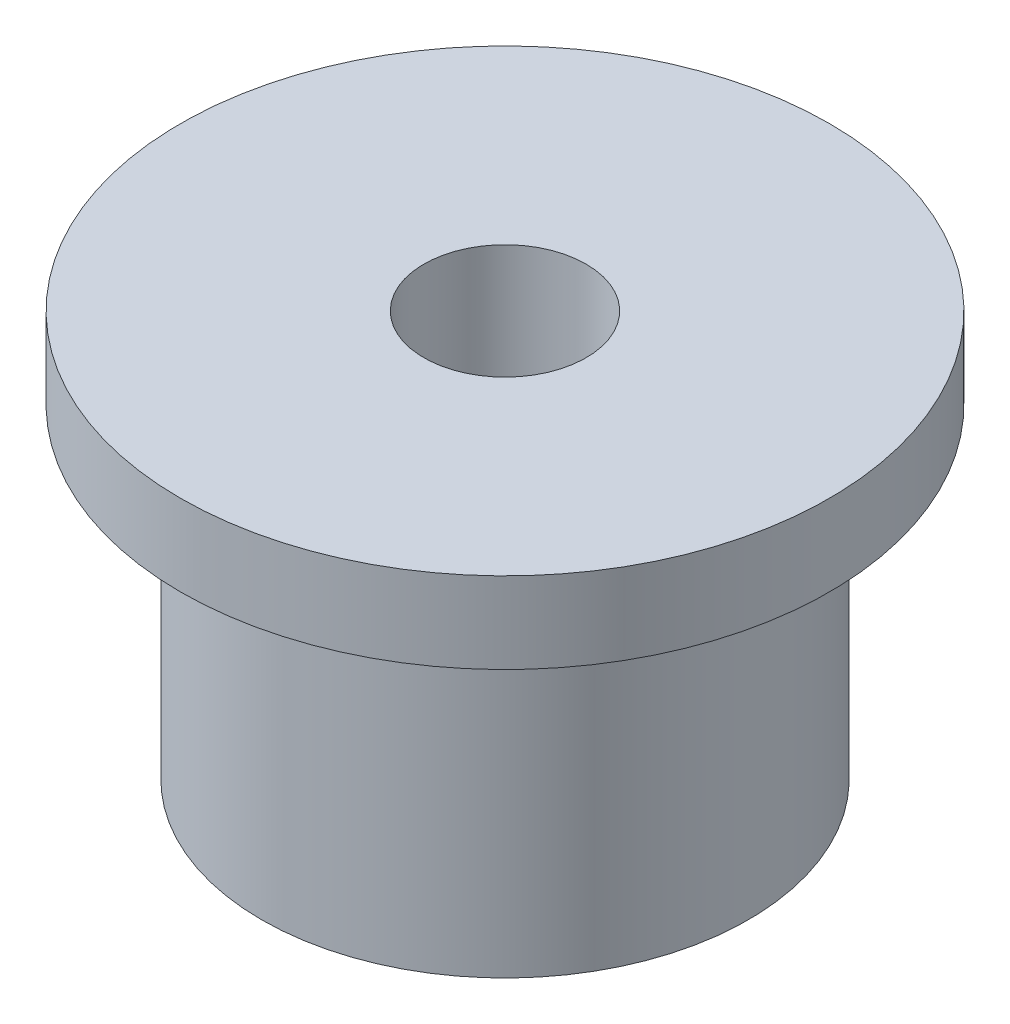
ISO-10303-21;
HEADER;
FILE_DESCRIPTION(('STEP AP214'),'2;1');
FILE_NAME('part.step','',(''),(''),'','','');
FILE_SCHEMA(('AUTOMOTIVE_DESIGN { 1 0 10303 214 1 1 1 1 }'));
ENDSEC;
DATA;
#1=APPLICATION_CONTEXT('core data for automotive mechanical design processes');
#2=APPLICATION_PROTOCOL_DEFINITION('international standard','automotive_design',2000,#1);
#3=PRODUCT_CONTEXT('',#1,'mechanical');
#4=PRODUCT('Part','Part','',(#3));
#5=PRODUCT_RELATED_PRODUCT_CATEGORY('part','',(#4));
#6=PRODUCT_DEFINITION_FORMATION('','',#4);
#7=PRODUCT_DEFINITION_CONTEXT('part definition',#1,'design');
#8=PRODUCT_DEFINITION('design','',#6,#7);
#9=PRODUCT_DEFINITION_SHAPE('','',#8);
#10=(LENGTH_UNIT() NAMED_UNIT(*) SI_UNIT(.MILLI.,.METRE.));
#11=(NAMED_UNIT(*) PLANE_ANGLE_UNIT() SI_UNIT($,.RADIAN.));
#12=(NAMED_UNIT(*) SI_UNIT($,.STERADIAN.) SOLID_ANGLE_UNIT());
#13=UNCERTAINTY_MEASURE_WITH_UNIT(LENGTH_MEASURE(1.E-05),#10,'distance_accuracy_value','');
#14=(GEOMETRIC_REPRESENTATION_CONTEXT(3) GLOBAL_UNCERTAINTY_ASSIGNED_CONTEXT((#13)) GLOBAL_UNIT_ASSIGNED_CONTEXT((#10,
#11,#12)) REPRESENTATION_CONTEXT('',''));
#15=CARTESIAN_POINT('',(0.,0.,0.));
#16=DIRECTION('',(0.,0.,1.));
#17=DIRECTION('',(1.,0.,0.));
#18=AXIS2_PLACEMENT_3D('',#15,#16,#17);
#19=CARTESIAN_POINT('',(75.,0.,0.));
#20=DIRECTION('',(0.,-1.,0.));
#21=DIRECTION('',(0.,0.,-1.));
#22=AXIS2_PLACEMENT_3D('',#19,#20,#21);
#23=PLANE('',#22);
#24=CARTESIAN_POINT('',(0.,0.,0.));
#25=DIRECTION('',(0.,-1.,0.));
#26=DIRECTION('',(0.,0.,-1.));
#27=AXIS2_PLACEMENT_3D('',#24,#25,#26);
#28=CIRCLE('',#27,75.);
#29=CARTESIAN_POINT('',(0.,0.,-75.));
#30=VERTEX_POINT('',#29);
#31=EDGE_CURVE('E57',#30,#30,#28,.T.);
#32=ORIENTED_EDGE('',*,*,#31,.T.);
#33=EDGE_LOOP('',(#32));
#34=FACE_BOUND('',#33,.T.);
#35=CARTESIAN_POINT('',(0.,0.,0.));
#36=DIRECTION('',(0.,-1.,0.));
#37=DIRECTION('',(0.,0.,-1.));
#38=AXIS2_PLACEMENT_3D('',#35,#36,#37);
#39=CIRCLE('',#38,25.);
#40=CARTESIAN_POINT('',(0.,0.,-25.));
#41=VERTEX_POINT('',#40);
#42=EDGE_CURVE('E10',#41,#41,#39,.T.);
#43=ORIENTED_EDGE('',*,*,#42,.F.);
#44=EDGE_LOOP('',(#43));
#45=FACE_BOUND('',#44,.T.);
#46=ADVANCED_FACE('F35',(#34,#45),#23,.T.);
#47=CARTESIAN_POINT('',(0.,0.,0.));
#48=DIRECTION('',(0.,-1.,0.));
#49=DIRECTION('',(0.,0.,-1.));
#50=AXIS2_PLACEMENT_3D('',#47,#48,#49);
#51=CYLINDRICAL_SURFACE('',#50,25.);
#52=ORIENTED_EDGE('',*,*,#42,.T.);
#53=EDGE_LOOP('',(#52));
#54=FACE_BOUND('',#53,.T.);
#55=CARTESIAN_POINT('',(0.,125.,0.));
#56=DIRECTION('',(0.,-1.,0.));
#57=DIRECTION('',(0.,0.,-1.));
#58=AXIS2_PLACEMENT_3D('',#55,#56,#57);
#59=CIRCLE('',#58,25.);
#60=CARTESIAN_POINT('',(0.,125.,-25.));
#61=VERTEX_POINT('',#60);
#62=EDGE_CURVE('E41',#61,#61,#59,.T.);
#63=ORIENTED_EDGE('',*,*,#62,.F.);
#64=EDGE_LOOP('',(#63));
#65=FACE_BOUND('',#64,.T.);
#66=ADVANCED_FACE('F75',(#54,#65),#51,.F.);
#67=CARTESIAN_POINT('',(25.,125.,0.));
#68=DIRECTION('',(0.,1.,0.));
#69=DIRECTION('',(0.,0.,1.));
#70=AXIS2_PLACEMENT_3D('',#67,#68,#69);
#71=PLANE('',#70);
#72=ORIENTED_EDGE('',*,*,#62,.T.);
#73=EDGE_LOOP('',(#72));
#74=FACE_BOUND('',#73,.T.);
#75=CARTESIAN_POINT('',(0.,125.,0.));
#76=DIRECTION('',(0.,-1.,0.));
#77=DIRECTION('',(0.,0.,-1.));
#78=AXIS2_PLACEMENT_3D('',#75,#76,#77);
#79=CIRCLE('',#78,100.);
#80=CARTESIAN_POINT('',(0.,125.,-100.));
#81=VERTEX_POINT('',#80);
#82=EDGE_CURVE('E45',#81,#81,#79,.T.);
#83=ORIENTED_EDGE('',*,*,#82,.F.);
#84=EDGE_LOOP('',(#83));
#85=FACE_BOUND('',#84,.T.);
#86=ADVANCED_FACE('F79',(#74,#85),#71,.T.);
#87=CARTESIAN_POINT('',(0.,0.,0.));
#88=DIRECTION('',(0.,-1.,0.));
#89=DIRECTION('',(0.,0.,-1.));
#90=AXIS2_PLACEMENT_3D('',#87,#88,#89);
#91=CYLINDRICAL_SURFACE('',#90,100.);
#92=ORIENTED_EDGE('',*,*,#82,.T.);
#93=EDGE_LOOP('',(#92));
#94=FACE_BOUND('',#93,.T.);
#95=CARTESIAN_POINT('',(0.,100.,0.));
#96=DIRECTION('',(0.,-1.,0.));
#97=DIRECTION('',(0.,0.,-1.));
#98=AXIS2_PLACEMENT_3D('',#95,#96,#97);
#99=CIRCLE('',#98,100.);
#100=CARTESIAN_POINT('',(0.,100.,-100.));
#101=VERTEX_POINT('',#100);
#102=EDGE_CURVE('E49',#101,#101,#99,.T.);
#103=ORIENTED_EDGE('',*,*,#102,.F.);
#104=EDGE_LOOP('',(#103));
#105=FACE_BOUND('',#104,.T.);
#106=ADVANCED_FACE('F71',(#94,#105),#91,.T.);
#107=CARTESIAN_POINT('',(100.,100.,0.));
#108=DIRECTION('',(0.,-1.,0.));
#109=DIRECTION('',(0.,0.,-1.));
#110=AXIS2_PLACEMENT_3D('',#107,#108,#109);
#111=PLANE('',#110);
#112=ORIENTED_EDGE('',*,*,#102,.T.);
#113=EDGE_LOOP('',(#112));
#114=FACE_BOUND('',#113,.T.);
#115=CARTESIAN_POINT('',(0.,100.,0.));
#116=DIRECTION('',(0.,-1.,0.));
#117=DIRECTION('',(0.,0.,-1.));
#118=AXIS2_PLACEMENT_3D('',#115,#116,#117);
#119=CIRCLE('',#118,75.);
#120=CARTESIAN_POINT('',(0.,100.,-75.));
#121=VERTEX_POINT('',#120);
#122=EDGE_CURVE('E54',#121,#121,#119,.T.);
#123=ORIENTED_EDGE('',*,*,#122,.F.);
#124=EDGE_LOOP('',(#123));
#125=FACE_BOUND('',#124,.T.);
#126=ADVANCED_FACE('F65',(#114,#125),#111,.T.);
#127=CARTESIAN_POINT('',(0.,0.,0.));
#128=DIRECTION('',(0.,-1.,0.));
#129=DIRECTION('',(0.,0.,-1.));
#130=AXIS2_PLACEMENT_3D('',#127,#128,#129);
#131=CYLINDRICAL_SURFACE('',#130,75.);
#132=ORIENTED_EDGE('',*,*,#122,.T.);
#133=EDGE_LOOP('',(#132));
#134=FACE_BOUND('',#133,.T.);
#135=ORIENTED_EDGE('',*,*,#31,.F.);
#136=EDGE_LOOP('',(#135));
#137=FACE_BOUND('',#136,.T.);
#138=ADVANCED_FACE('F63',(#134,#137),#131,.T.);
#139=CLOSED_SHELL('',(#46,#66,#86,#106,#126,#138));
#140=MANIFOLD_SOLID_BREP('B2',#139);
#141=ADVANCED_BREP_SHAPE_REPRESENTATION('',(#18,#140),#14);
#142=SHAPE_DEFINITION_REPRESENTATION(#9,#141);
ENDSEC;
END-ISO-10303-21;
